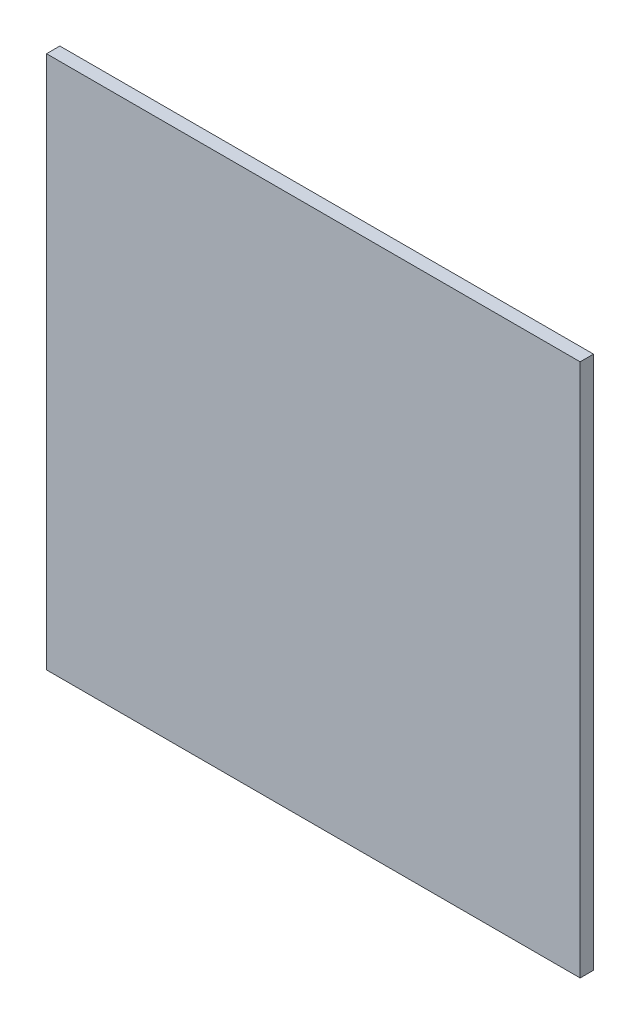
ISO-10303-21;
HEADER;
FILE_DESCRIPTION(('STEP AP214'),'2;1');
FILE_NAME('part.step','',(''),(''),'','','');
FILE_SCHEMA(('AUTOMOTIVE_DESIGN { 1 0 10303 214 1 1 1 1 }'));
ENDSEC;
DATA;
#1=APPLICATION_CONTEXT('core data for automotive mechanical design processes');
#2=APPLICATION_PROTOCOL_DEFINITION('international standard','automotive_design',2000,#1);
#3=PRODUCT_CONTEXT('',#1,'mechanical');
#4=PRODUCT('Part','Part','',(#3));
#5=PRODUCT_RELATED_PRODUCT_CATEGORY('part','',(#4));
#6=PRODUCT_DEFINITION_FORMATION('','',#4);
#7=PRODUCT_DEFINITION_CONTEXT('part definition',#1,'design');
#8=PRODUCT_DEFINITION('design','',#6,#7);
#9=PRODUCT_DEFINITION_SHAPE('','',#8);
#10=(LENGTH_UNIT() NAMED_UNIT(*) SI_UNIT(.MILLI.,.METRE.));
#11=(NAMED_UNIT(*) PLANE_ANGLE_UNIT() SI_UNIT($,.RADIAN.));
#12=(NAMED_UNIT(*) SI_UNIT($,.STERADIAN.) SOLID_ANGLE_UNIT());
#13=UNCERTAINTY_MEASURE_WITH_UNIT(LENGTH_MEASURE(1.E-05),#10,'distance_accuracy_value','');
#14=(GEOMETRIC_REPRESENTATION_CONTEXT(3) GLOBAL_UNCERTAINTY_ASSIGNED_CONTEXT((#13)) GLOBAL_UNIT_ASSIGNED_CONTEXT((#10,
#11,#12)) REPRESENTATION_CONTEXT('',''));
#15=CARTESIAN_POINT('',(0.,0.,0.));
#16=DIRECTION('',(0.,0.,1.));
#17=DIRECTION('',(1.,0.,0.));
#18=AXIS2_PLACEMENT_3D('',#15,#16,#17);
#19=CARTESIAN_POINT('',(-200.,200.,10.));
#20=DIRECTION('',(1.,0.,0.));
#21=DIRECTION('',(0.,1.,0.));
#22=AXIS2_PLACEMENT_3D('',#19,#20,#21);
#23=PLANE('',#22);
#24=DIRECTION('',(0.,-1.,0.));
#25=VECTOR('',#24,1.);
#26=CARTESIAN_POINT('',(-200.,200.,0.));
#27=LINE('',#26,#25);
#28=CARTESIAN_POINT('',(-200.,200.,0.));
#29=VERTEX_POINT('',#28);
#30=CARTESIAN_POINT('',(-200.,-200.,0.));
#31=VERTEX_POINT('',#30);
#32=EDGE_CURVE('E95',#29,#31,#27,.T.);
#33=ORIENTED_EDGE('',*,*,#32,.T.);
#34=DIRECTION('',(0.,0.,-1.));
#35=VECTOR('',#34,1.);
#36=CARTESIAN_POINT('',(-200.,-200.,10.));
#37=LINE('',#36,#35);
#38=CARTESIAN_POINT('',(-200.,-200.,10.));
#39=VERTEX_POINT('',#38);
#40=EDGE_CURVE('E11',#39,#31,#37,.T.);
#41=ORIENTED_EDGE('',*,*,#40,.F.);
#42=DIRECTION('',(0.,-1.,0.));
#43=VECTOR('',#42,1.);
#44=CARTESIAN_POINT('',(-200.,200.,10.));
#45=LINE('',#44,#43);
#46=CARTESIAN_POINT('',(-200.,200.,10.));
#47=VERTEX_POINT('',#46);
#48=EDGE_CURVE('E83',#47,#39,#45,.T.);
#49=ORIENTED_EDGE('',*,*,#48,.F.);
#50=DIRECTION('',(0.,0.,-1.));
#51=VECTOR('',#50,1.);
#52=CARTESIAN_POINT('',(-200.,200.,10.));
#53=LINE('',#52,#51);
#54=EDGE_CURVE('E91',#47,#29,#53,.T.);
#55=ORIENTED_EDGE('',*,*,#54,.T.);
#56=EDGE_LOOP('',(#33,#41,#49,#55));
#57=FACE_BOUND('',#56,.T.);
#58=ADVANCED_FACE('F32',(#57),#23,.F.);
#59=CARTESIAN_POINT('',(-200.,-200.,10.));
#60=DIRECTION('',(0.,1.,0.));
#61=DIRECTION('',(0.,0.,1.));
#62=AXIS2_PLACEMENT_3D('',#59,#60,#61);
#63=PLANE('',#62);
#64=DIRECTION('',(1.,0.,0.));
#65=VECTOR('',#64,1.);
#66=CARTESIAN_POINT('',(-200.,-200.,0.));
#67=LINE('',#66,#65);
#68=CARTESIAN_POINT('',(200.,-200.,0.));
#69=VERTEX_POINT('',#68);
#70=EDGE_CURVE('E87',#31,#69,#67,.T.);
#71=ORIENTED_EDGE('',*,*,#70,.T.);
#72=DIRECTION('',(0.,0.,-1.));
#73=VECTOR('',#72,1.);
#74=CARTESIAN_POINT('',(200.,-200.,10.));
#75=LINE('',#74,#73);
#76=CARTESIAN_POINT('',(200.,-200.,10.));
#77=VERTEX_POINT('',#76);
#78=EDGE_CURVE('E40',#77,#69,#75,.T.);
#79=ORIENTED_EDGE('',*,*,#78,.F.);
#80=DIRECTION('',(1.,0.,0.));
#81=VECTOR('',#80,1.);
#82=CARTESIAN_POINT('',(-200.,-200.,10.));
#83=LINE('',#82,#81);
#84=EDGE_CURVE('E78',#39,#77,#83,.T.);
#85=ORIENTED_EDGE('',*,*,#84,.F.);
#86=ORIENTED_EDGE('',*,*,#40,.T.);
#87=EDGE_LOOP('',(#71,#79,#85,#86));
#88=FACE_BOUND('',#87,.T.);
#89=ADVANCED_FACE('F86',(#88),#63,.F.);
#90=CARTESIAN_POINT('',(200.,200.,10.));
#91=DIRECTION('',(-1.,0.,0.));
#92=DIRECTION('',(0.,0.,1.));
#93=AXIS2_PLACEMENT_3D('',#90,#91,#92);
#94=PLANE('',#93);
#95=DIRECTION('',(0.,1.,0.));
#96=VECTOR('',#95,1.);
#97=CARTESIAN_POINT('',(200.,200.,0.));
#98=LINE('',#97,#96);
#99=CARTESIAN_POINT('',(200.,200.,0.));
#100=VERTEX_POINT('',#99);
#101=EDGE_CURVE('E65',#69,#100,#98,.T.);
#102=ORIENTED_EDGE('',*,*,#101,.T.);
#103=DIRECTION('',(0.,0.,-1.));
#104=VECTOR('',#103,1.);
#105=CARTESIAN_POINT('',(200.,200.,10.));
#106=LINE('',#105,#104);
#107=CARTESIAN_POINT('',(200.,200.,10.));
#108=VERTEX_POINT('',#107);
#109=EDGE_CURVE('E88',#108,#100,#106,.T.);
#110=ORIENTED_EDGE('',*,*,#109,.F.);
#111=DIRECTION('',(0.,1.,0.));
#112=VECTOR('',#111,1.);
#113=CARTESIAN_POINT('',(200.,200.,10.));
#114=LINE('',#113,#112);
#115=EDGE_CURVE('E81',#77,#108,#114,.T.);
#116=ORIENTED_EDGE('',*,*,#115,.F.);
#117=ORIENTED_EDGE('',*,*,#78,.T.);
#118=EDGE_LOOP('',(#102,#110,#116,#117));
#119=FACE_BOUND('',#118,.T.);
#120=ADVANCED_FACE('F89',(#119),#94,.F.);
#121=CARTESIAN_POINT('',(-200.,200.,10.));
#122=DIRECTION('',(0.,-1.,0.));
#123=DIRECTION('',(0.,0.,-1.));
#124=AXIS2_PLACEMENT_3D('',#121,#122,#123);
#125=PLANE('',#124);
#126=DIRECTION('',(-1.,0.,0.));
#127=VECTOR('',#126,1.);
#128=CARTESIAN_POINT('',(-200.,200.,0.));
#129=LINE('',#128,#127);
#130=EDGE_CURVE('E71',#100,#29,#129,.T.);
#131=ORIENTED_EDGE('',*,*,#130,.T.);
#132=ORIENTED_EDGE('',*,*,#54,.F.);
#133=DIRECTION('',(-1.,0.,0.));
#134=VECTOR('',#133,1.);
#135=CARTESIAN_POINT('',(-200.,200.,10.));
#136=LINE('',#135,#134);
#137=EDGE_CURVE('E48',#108,#47,#136,.T.);
#138=ORIENTED_EDGE('',*,*,#137,.F.);
#139=ORIENTED_EDGE('',*,*,#109,.T.);
#140=EDGE_LOOP('',(#131,#132,#138,#139));
#141=FACE_BOUND('',#140,.T.);
#142=ADVANCED_FACE('F102',(#141),#125,.F.);
#143=CARTESIAN_POINT('',(0.,0.,10.));
#144=DIRECTION('',(0.,0.,1.));
#145=DIRECTION('',(1.,0.,0.));
#146=AXIS2_PLACEMENT_3D('',#143,#144,#145);
#147=PLANE('',#146);
#148=ORIENTED_EDGE('',*,*,#48,.T.);
#149=ORIENTED_EDGE('',*,*,#84,.T.);
#150=ORIENTED_EDGE('',*,*,#115,.T.);
#151=ORIENTED_EDGE('',*,*,#137,.T.);
#152=EDGE_LOOP('',(#148,#149,#150,#151));
#153=FACE_BOUND('',#152,.T.);
#154=ADVANCED_FACE('F79',(#153),#147,.T.);
#155=CARTESIAN_POINT('',(0.,0.,0.));
#156=DIRECTION('',(0.,0.,1.));
#157=DIRECTION('',(1.,0.,0.));
#158=AXIS2_PLACEMENT_3D('',#155,#156,#157);
#159=PLANE('',#158);
#160=ORIENTED_EDGE('',*,*,#32,.F.);
#161=ORIENTED_EDGE('',*,*,#130,.F.);
#162=ORIENTED_EDGE('',*,*,#101,.F.);
#163=ORIENTED_EDGE('',*,*,#70,.F.);
#164=EDGE_LOOP('',(#160,#161,#162,#163));
#165=FACE_BOUND('',#164,.T.);
#166=ADVANCED_FACE('F105',(#165),#159,.F.);
#167=CLOSED_SHELL('',(#58,#89,#120,#142,#154,#166));
#168=MANIFOLD_SOLID_BREP('B2',#167);
#169=ADVANCED_BREP_SHAPE_REPRESENTATION('',(#18,#168),#14);
#170=SHAPE_DEFINITION_REPRESENTATION(#9,#169);
ENDSEC;
END-ISO-10303-21;
